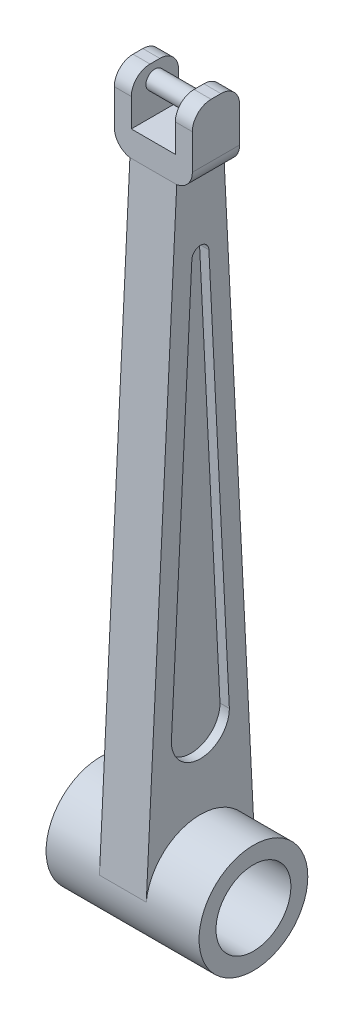
ISO-10303-21;
HEADER;
FILE_DESCRIPTION(('STEP AP214'),'2;1');
FILE_NAME('part.step','',(''),(''),'','','');
FILE_SCHEMA(('AUTOMOTIVE_DESIGN { 1 0 10303 214 1 1 1 1 }'));
ENDSEC;
DATA;
#1=APPLICATION_CONTEXT('core data for automotive mechanical design processes');
#2=APPLICATION_PROTOCOL_DEFINITION('international standard','automotive_design',2000,#1);
#3=PRODUCT_CONTEXT('',#1,'mechanical');
#4=PRODUCT('Part','Part','',(#3));
#5=PRODUCT_RELATED_PRODUCT_CATEGORY('part','',(#4));
#6=PRODUCT_DEFINITION_FORMATION('','',#4);
#7=PRODUCT_DEFINITION_CONTEXT('part definition',#1,'design');
#8=PRODUCT_DEFINITION('design','',#6,#7);
#9=PRODUCT_DEFINITION_SHAPE('','',#8);
#10=(LENGTH_UNIT() NAMED_UNIT(*) SI_UNIT(.MILLI.,.METRE.));
#11=(NAMED_UNIT(*) PLANE_ANGLE_UNIT() SI_UNIT($,.RADIAN.));
#12=(NAMED_UNIT(*) SI_UNIT($,.STERADIAN.) SOLID_ANGLE_UNIT());
#13=UNCERTAINTY_MEASURE_WITH_UNIT(LENGTH_MEASURE(1.E-05),#10,'distance_accuracy_value','');
#14=(GEOMETRIC_REPRESENTATION_CONTEXT(3) GLOBAL_UNCERTAINTY_ASSIGNED_CONTEXT((#13)) GLOBAL_UNIT_ASSIGNED_CONTEXT((#10,
#11,#12)) REPRESENTATION_CONTEXT('',''));
#15=CARTESIAN_POINT('',(0.,0.,0.));
#16=DIRECTION('',(0.,0.,1.));
#17=DIRECTION('',(1.,0.,0.));
#18=AXIS2_PLACEMENT_3D('',#15,#16,#17);
#19=CARTESIAN_POINT('',(6.24999999999999,106.094443710162,3.78478800638868));
#20=DIRECTION('',(0.,1.,0.));
#21=DIRECTION('',(0.,0.,1.));
#22=AXIS2_PLACEMENT_3D('',#19,#20,#21);
#23=PLANE('',#22);
#24=DIRECTION('',(-1.,0.,0.));
#25=VECTOR('',#24,1.);
#26=CARTESIAN_POINT('',(6.24999999999999,106.094443710162,3.78478800638868));
#27=LINE('',#26,#25);
#28=CARTESIAN_POINT('',(3.52500846736764,106.094443710162,3.78478800638868));
#29=VERTEX_POINT('',#28);
#30=CARTESIAN_POINT('',(-3.52500846736764,106.094443710162,3.78478800638868));
#31=VERTEX_POINT('',#30);
#32=EDGE_CURVE('E219',#29,#31,#27,.T.);
#33=ORIENTED_EDGE('',*,*,#32,.F.);
#34=DIRECTION('',(0.,0.,1.));
#35=VECTOR('',#34,1.);
#36=CARTESIAN_POINT('',(3.52500846736764,106.094443710162,-3.78478800638867));
#37=LINE('',#36,#35);
#38=CARTESIAN_POINT('',(3.52500846736764,106.094443710162,-3.78478800638867));
#39=VERTEX_POINT('',#38);
#40=EDGE_CURVE('E217',#39,#29,#37,.T.);
#41=ORIENTED_EDGE('',*,*,#40,.F.);
#42=DIRECTION('',(-1.,0.,0.));
#43=VECTOR('',#42,1.);
#44=CARTESIAN_POINT('',(6.24999999999999,106.094443710162,-3.78478800638867));
#45=LINE('',#44,#43);
#46=CARTESIAN_POINT('',(-3.52500846736764,106.094443710162,-3.78478800638867));
#47=VERTEX_POINT('',#46);
#48=EDGE_CURVE('E203',#39,#47,#45,.T.);
#49=ORIENTED_EDGE('',*,*,#48,.T.);
#50=DIRECTION('',(0.,0.,-1.));
#51=VECTOR('',#50,1.);
#52=CARTESIAN_POINT('',(-3.52500846736764,106.094443710162,-3.78478800638867));
#53=LINE('',#52,#51);
#54=EDGE_CURVE('E215',#31,#47,#53,.T.);
#55=ORIENTED_EDGE('',*,*,#54,.F.);
#56=EDGE_LOOP('',(#33,#41,#49,#55));
#57=FACE_BOUND('',#56,.T.);
#58=ADVANCED_FACE('F38',(#57),#23,.T.);
#59=CARTESIAN_POINT('',(3.75,25.1418620019097,0.));
#60=DIRECTION('',(-1.,0.,0.));
#61=DIRECTION('',(0.,0.,1.));
#62=AXIS2_PLACEMENT_3D('',#59,#60,#61);
#63=CYLINDRICAL_SURFACE('',#62,4.64368791552873);
#64=DIRECTION('',(-1.,0.,0.));
#65=VECTOR('',#64,1.);
#66=CARTESIAN_POINT('',(3.75,25.1418620019097,-4.64368791552873));
#67=LINE('',#66,#65);
#68=CARTESIAN_POINT('',(3.75,25.1418620019097,-4.64368791552873));
#69=VERTEX_POINT('',#68);
#70=CARTESIAN_POINT('',(2.25,25.1418620019097,-4.64368791552873));
#71=VERTEX_POINT('',#70);
#72=EDGE_CURVE('E333',#69,#71,#67,.T.);
#73=ORIENTED_EDGE('',*,*,#72,.T.);
#74=CARTESIAN_POINT('',(2.25,25.1418620019097,0.));
#75=DIRECTION('',(1.,0.,0.));
#76=DIRECTION('',(0.,0.,-1.));
#77=AXIS2_PLACEMENT_3D('',#74,#75,#76);
#78=CIRCLE('',#77,4.64368791552873);
#79=CARTESIAN_POINT('',(2.25,25.1418620019097,4.64368791552872));
#80=VERTEX_POINT('',#79);
#81=EDGE_CURVE('E270',#80,#71,#78,.T.);
#82=ORIENTED_EDGE('',*,*,#81,.F.);
#83=DIRECTION('',(-1.,0.,0.));
#84=VECTOR('',#83,1.);
#85=CARTESIAN_POINT('',(3.75,25.1418620019097,4.64368791552872));
#86=LINE('',#85,#84);
#87=CARTESIAN_POINT('',(3.75,25.1418620019097,4.64368791552872));
#88=VERTEX_POINT('',#87);
#89=EDGE_CURVE('E329',#88,#80,#86,.T.);
#90=ORIENTED_EDGE('',*,*,#89,.F.);
#91=CARTESIAN_POINT('',(3.75,25.1418620019097,0.));
#92=DIRECTION('',(1.,0.,0.));
#93=DIRECTION('',(0.,0.,-1.));
#94=AXIS2_PLACEMENT_3D('',#91,#92,#93);
#95=CIRCLE('',#94,4.64368791552873);
#96=EDGE_CURVE('E285',#88,#69,#95,.T.);
#97=ORIENTED_EDGE('',*,*,#96,.T.);
#98=EDGE_LOOP('',(#73,#82,#90,#97));
#99=FACE_BOUND('',#98,.T.);
#100=ADVANCED_FACE('F469',(#99),#63,.F.);
#101=CARTESIAN_POINT('',(3.75,0.296098394583436,5.89224310639407));
#102=DIRECTION('',(0.,-0.0501889058364647,-0.99873974274129));
#103=DIRECTION('',(0.,0.99873974274129,-0.0501889058364647));
#104=AXIS2_PLACEMENT_3D('',#101,#102,#103);
#105=PLANE('',#104);
#106=ORIENTED_EDGE('',*,*,#89,.T.);
#107=DIRECTION('',(0.,-0.99873974274129,0.0501889058364647));
#108=VECTOR('',#107,1.);
#109=CARTESIAN_POINT('',(2.25,90.3954705550591,1.36454814066158));
#110=LINE('',#109,#108);
#111=CARTESIAN_POINT('',(2.25,90.3954705550591,1.36454814066158));
#112=VERTEX_POINT('',#111);
#113=EDGE_CURVE('E273',#112,#80,#110,.T.);
#114=ORIENTED_EDGE('',*,*,#113,.F.);
#115=DIRECTION('',(-1.,0.,0.));
#116=VECTOR('',#115,1.);
#117=CARTESIAN_POINT('',(3.75,90.3954705550591,1.36454814066158));
#118=LINE('',#117,#116);
#119=CARTESIAN_POINT('',(3.75,90.3954705550591,1.36454814066158));
#120=VERTEX_POINT('',#119);
#121=EDGE_CURVE('E340',#120,#112,#118,.T.);
#122=ORIENTED_EDGE('',*,*,#121,.F.);
#123=DIRECTION('',(0.,-0.99873974274129,0.0501889058364647));
#124=VECTOR('',#123,1.);
#125=CARTESIAN_POINT('',(3.75,0.296098394583436,5.89224310639407));
#126=LINE('',#125,#124);
#127=EDGE_CURVE('E288',#120,#88,#126,.T.);
#128=ORIENTED_EDGE('',*,*,#127,.T.);
#129=EDGE_LOOP('',(#106,#114,#122,#128));
#130=FACE_BOUND('',#129,.T.);
#131=ADVANCED_FACE('F474',(#130),#105,.T.);
#132=CARTESIAN_POINT('',(3.75,90.3268989590665,0.));
#133=DIRECTION('',(-1.,0.,0.));
#134=DIRECTION('',(0.,0.,1.));
#135=AXIS2_PLACEMENT_3D('',#132,#133,#134);
#136=CYLINDRICAL_SURFACE('',#135,1.36626999233678);
#137=CARTESIAN_POINT('',(2.25,90.3268989590665,0.));
#138=DIRECTION('',(-1.,0.,0.));
#139=DIRECTION('',(0.,0.,1.));
#140=AXIS2_PLACEMENT_3D('',#137,#138,#139);
#141=CIRCLE('',#140,1.36626999233678);
#142=CARTESIAN_POINT('',(2.25,90.3954705550591,-1.36454814066158));
#143=VERTEX_POINT('',#142);
#144=EDGE_CURVE('E264',#112,#143,#141,.T.);
#145=ORIENTED_EDGE('',*,*,#144,.T.);
#146=DIRECTION('',(-1.,0.,0.));
#147=VECTOR('',#146,1.);
#148=CARTESIAN_POINT('',(3.75,90.3954705550591,-1.36454814066158));
#149=LINE('',#148,#147);
#150=CARTESIAN_POINT('',(3.75,90.3954705550591,-1.36454814066158));
#151=VERTEX_POINT('',#150);
#152=EDGE_CURVE('E337',#151,#143,#149,.T.);
#153=ORIENTED_EDGE('',*,*,#152,.F.);
#154=CARTESIAN_POINT('',(3.75,90.3268989590665,0.));
#155=DIRECTION('',(1.,0.,0.));
#156=DIRECTION('',(0.,0.,-1.));
#157=AXIS2_PLACEMENT_3D('',#154,#155,#156);
#158=CIRCLE('',#157,1.36626999233678);
#159=EDGE_CURVE('E292',#120,#151,#158,.F.);
#160=ORIENTED_EDGE('',*,*,#159,.F.);
#161=ORIENTED_EDGE('',*,*,#121,.T.);
#162=EDGE_LOOP('',(#145,#153,#160,#161));
#163=FACE_BOUND('',#162,.T.);
#164=ADVANCED_FACE('F530',(#163),#136,.F.);
#165=CARTESIAN_POINT('',(3.75,0.296098394583438,-5.89224310639408));
#166=DIRECTION('',(0.,0.0501889058364649,-0.99873974274129));
#167=DIRECTION('',(0.,0.99873974274129,0.0501889058364649));
#168=AXIS2_PLACEMENT_3D('',#165,#166,#167);
#169=PLANE('',#168);
#170=DIRECTION('',(0.,-0.99873974274129,-0.0501889058364649));
#171=VECTOR('',#170,1.);
#172=CARTESIAN_POINT('',(2.25,90.3954705550591,-1.36454814066158));
#173=LINE('',#172,#171);
#174=EDGE_CURVE('E267',#143,#71,#173,.T.);
#175=ORIENTED_EDGE('',*,*,#174,.T.);
#176=ORIENTED_EDGE('',*,*,#72,.F.);
#177=DIRECTION('',(0.,-0.99873974274129,-0.0501889058364649));
#178=VECTOR('',#177,1.);
#179=CARTESIAN_POINT('',(3.75,0.296098394583438,-5.89224310639408));
#180=LINE('',#179,#178);
#181=EDGE_CURVE('E294',#151,#69,#180,.T.);
#182=ORIENTED_EDGE('',*,*,#181,.F.);
#183=ORIENTED_EDGE('',*,*,#152,.T.);
#184=EDGE_LOOP('',(#175,#176,#182,#183));
#185=FACE_BOUND('',#184,.T.);
#186=ADVANCED_FACE('F521',(#185),#169,.F.);
#187=CARTESIAN_POINT('',(3.75,0.446665112092829,8.88846233461794));
#188=DIRECTION('',(0.,-0.0501889058364646,-0.99873974274129));
#189=DIRECTION('',(0.,0.99873974274129,-0.0501889058364646));
#190=AXIS2_PLACEMENT_3D('',#187,#188,#189);
#191=PLANE('',#190);
#192=DIRECTION('',(0.,-0.99873974274129,0.0501889058364646));
#193=VECTOR('',#192,1.);
#194=CARTESIAN_POINT('',(-3.75,0.446665112092829,8.88846233461794));
#195=LINE('',#194,#193);
#196=CARTESIAN_POINT('',(-3.75,102.00780299025,3.78478800638868));
#197=VERTEX_POINT('',#196);
#198=CARTESIAN_POINT('',(-3.75,4.92404461233952,8.66346400070242));
#199=VERTEX_POINT('',#198);
#200=EDGE_CURVE('E317',#197,#199,#195,.T.);
#201=ORIENTED_EDGE('',*,*,#200,.T.);
#202=DIRECTION('',(1.,0.,0.));
#203=VECTOR('',#202,1.);
#204=CARTESIAN_POINT('',(-12.25,4.92404461233952,8.66346400070242));
#205=LINE('',#204,#203);
#206=CARTESIAN_POINT('',(3.75,4.92404461233952,8.66346400070242));
#207=VERTEX_POINT('',#206);
#208=EDGE_CURVE('E260',#199,#207,#205,.T.);
#209=ORIENTED_EDGE('',*,*,#208,.T.);
#210=DIRECTION('',(0.,-0.99873974274129,0.0501889058364646));
#211=VECTOR('',#210,1.);
#212=CARTESIAN_POINT('',(3.75,0.446665112092829,8.88846233461794));
#213=LINE('',#212,#211);
#214=CARTESIAN_POINT('',(3.75,102.00780299025,3.78478800638868));
#215=VERTEX_POINT('',#214);
#216=EDGE_CURVE('E296',#215,#207,#213,.T.);
#217=ORIENTED_EDGE('',*,*,#216,.F.);
#218=DIRECTION('',(-1.,0.,0.));
#219=VECTOR('',#218,1.);
#220=CARTESIAN_POINT('',(3.75,102.00780299025,3.78478800638868));
#221=LINE('',#220,#219);
#222=EDGE_CURVE('E325',#215,#197,#221,.T.);
#223=ORIENTED_EDGE('',*,*,#222,.T.);
#224=EDGE_LOOP('',(#201,#209,#217,#223));
#225=FACE_BOUND('',#224,.T.);
#226=ADVANCED_FACE('F423',(#225),#191,.F.);
#227=CARTESIAN_POINT('',(3.75,0.446665112092832,-8.88846233461795));
#228=DIRECTION('',(0.,0.0501889058364649,-0.99873974274129));
#229=DIRECTION('',(0.,0.99873974274129,0.0501889058364649));
#230=AXIS2_PLACEMENT_3D('',#227,#228,#229);
#231=PLANE('',#230);
#232=DIRECTION('',(1.,0.,0.));
#233=VECTOR('',#232,1.);
#234=CARTESIAN_POINT('',(-12.25,4.92404461233949,-8.66346400070244));
#235=LINE('',#234,#233);
#236=CARTESIAN_POINT('',(-3.75,4.92404461233949,-8.66346400070244));
#237=VERTEX_POINT('',#236);
#238=CARTESIAN_POINT('',(3.75,4.92404461233949,-8.66346400070244));
#239=VERTEX_POINT('',#238);
#240=EDGE_CURVE('E256',#237,#239,#235,.T.);
#241=ORIENTED_EDGE('',*,*,#240,.F.);
#242=DIRECTION('',(0.,-0.99873974274129,-0.0501889058364649));
#243=VECTOR('',#242,1.);
#244=CARTESIAN_POINT('',(-3.75,0.446665112092832,-8.88846233461795));
#245=LINE('',#244,#243);
#246=CARTESIAN_POINT('',(-3.75,102.00780299025,-3.78478800638867));
#247=VERTEX_POINT('',#246);
#248=EDGE_CURVE('E320',#247,#237,#245,.T.);
#249=ORIENTED_EDGE('',*,*,#248,.F.);
#250=DIRECTION('',(-1.,0.,0.));
#251=VECTOR('',#250,1.);
#252=CARTESIAN_POINT('',(3.75,102.00780299025,-3.78478800638867));
#253=LINE('',#252,#251);
#254=CARTESIAN_POINT('',(3.75,102.00780299025,-3.78478800638867));
#255=VERTEX_POINT('',#254);
#256=EDGE_CURVE('E328',#255,#247,#253,.T.);
#257=ORIENTED_EDGE('',*,*,#256,.F.);
#258=DIRECTION('',(0.,-0.99873974274129,-0.0501889058364649));
#259=VECTOR('',#258,1.);
#260=CARTESIAN_POINT('',(3.75,0.446665112092832,-8.88846233461795));
#261=LINE('',#260,#259);
#262=EDGE_CURVE('E299',#255,#239,#261,.T.);
#263=ORIENTED_EDGE('',*,*,#262,.T.);
#264=EDGE_LOOP('',(#241,#249,#257,#263));
#265=FACE_BOUND('',#264,.T.);
#266=ADVANCED_FACE('F418',(#265),#231,.T.);
#267=CARTESIAN_POINT('',(-2.25,25.1418620019097,0.));
#268=DIRECTION('',(1.,0.,0.));
#269=DIRECTION('',(0.,0.,-1.));
#270=AXIS2_PLACEMENT_3D('',#267,#268,#269);
#271=CIRCLE('',#270,4.64368791552873);
#272=CARTESIAN_POINT('',(-2.25,25.1418620019097,4.64368791552872));
#273=VERTEX_POINT('',#272);
#274=CARTESIAN_POINT('',(-2.25,25.1418620019097,-4.64368791552873));
#275=VERTEX_POINT('',#274);
#276=EDGE_CURVE('E280',#273,#275,#271,.T.);
#277=ORIENTED_EDGE('',*,*,#276,.T.);
#278=CARTESIAN_POINT('',(-3.75,25.1418620019097,-4.64368791552873));
#279=VERTEX_POINT('',#278);
#280=EDGE_CURVE('E305',#275,#279,#67,.T.);
#281=ORIENTED_EDGE('',*,*,#280,.T.);
#282=CARTESIAN_POINT('',(-3.75,25.1418620019097,0.));
#283=DIRECTION('',(1.,0.,0.));
#284=DIRECTION('',(0.,0.,-1.));
#285=AXIS2_PLACEMENT_3D('',#282,#283,#284);
#286=CIRCLE('',#285,4.64368791552873);
#287=CARTESIAN_POINT('',(-3.75,25.1418620019097,4.64368791552872));
#288=VERTEX_POINT('',#287);
#289=EDGE_CURVE('E276',#288,#279,#286,.T.);
#290=ORIENTED_EDGE('',*,*,#289,.F.);
#291=EDGE_CURVE('E343',#273,#288,#86,.T.);
#292=ORIENTED_EDGE('',*,*,#291,.F.);
#293=EDGE_LOOP('',(#277,#281,#290,#292));
#294=FACE_BOUND('',#293,.T.);
#295=ADVANCED_FACE('F477',(#294),#63,.F.);
#296=DIRECTION('',(0.,-0.99873974274129,0.0501889058364647));
#297=VECTOR('',#296,1.);
#298=CARTESIAN_POINT('',(-2.25,90.3954705550591,1.36454814066158));
#299=LINE('',#298,#297);
#300=CARTESIAN_POINT('',(-2.25,90.3954705550591,1.36454814066158));
#301=VERTEX_POINT('',#300);
#302=EDGE_CURVE('E268',#301,#273,#299,.T.);
#303=ORIENTED_EDGE('',*,*,#302,.T.);
#304=ORIENTED_EDGE('',*,*,#291,.T.);
#305=DIRECTION('',(0.,-0.99873974274129,0.0501889058364647));
#306=VECTOR('',#305,1.);
#307=CARTESIAN_POINT('',(-3.75,0.296098394583436,5.89224310639407));
#308=LINE('',#307,#306);
#309=CARTESIAN_POINT('',(-3.75,90.3954705550591,1.36454814066158));
#310=VERTEX_POINT('',#309);
#311=EDGE_CURVE('E308',#310,#288,#308,.T.);
#312=ORIENTED_EDGE('',*,*,#311,.F.);
#313=EDGE_CURVE('E339',#301,#310,#118,.T.);
#314=ORIENTED_EDGE('',*,*,#313,.F.);
#315=EDGE_LOOP('',(#303,#304,#312,#314));
#316=FACE_BOUND('',#315,.T.);
#317=ADVANCED_FACE('F528',(#316),#105,.T.);
#318=CARTESIAN_POINT('',(-2.25,90.3954705550591,-1.36454814066158));
#319=VERTEX_POINT('',#318);
#320=CARTESIAN_POINT('',(-3.75,90.3954705550591,-1.36454814066158));
#321=VERTEX_POINT('',#320);
#322=EDGE_CURVE('E336',#319,#321,#149,.T.);
#323=ORIENTED_EDGE('',*,*,#322,.F.);
#324=CARTESIAN_POINT('',(-2.25,90.3268989590665,0.));
#325=DIRECTION('',(-1.,0.,0.));
#326=DIRECTION('',(0.,0.,1.));
#327=AXIS2_PLACEMENT_3D('',#324,#325,#326);
#328=CIRCLE('',#327,1.36626999233678);
#329=EDGE_CURVE('E259',#301,#319,#328,.T.);
#330=ORIENTED_EDGE('',*,*,#329,.F.);
#331=ORIENTED_EDGE('',*,*,#313,.T.);
#332=CARTESIAN_POINT('',(-3.75,90.3268989590665,0.));
#333=DIRECTION('',(1.,0.,0.));
#334=DIRECTION('',(0.,0.,-1.));
#335=AXIS2_PLACEMENT_3D('',#332,#333,#334);
#336=CIRCLE('',#335,1.36626999233678);
#337=EDGE_CURVE('E311',#310,#321,#336,.F.);
#338=ORIENTED_EDGE('',*,*,#337,.T.);
#339=EDGE_LOOP('',(#323,#330,#331,#338));
#340=FACE_BOUND('',#339,.T.);
#341=ADVANCED_FACE('F524',(#340),#136,.F.);
#342=ORIENTED_EDGE('',*,*,#280,.F.);
#343=DIRECTION('',(0.,-0.99873974274129,-0.0501889058364649));
#344=VECTOR('',#343,1.);
#345=CARTESIAN_POINT('',(-2.25,90.3954705550591,-1.36454814066158));
#346=LINE('',#345,#344);
#347=EDGE_CURVE('E278',#319,#275,#346,.T.);
#348=ORIENTED_EDGE('',*,*,#347,.F.);
#349=ORIENTED_EDGE('',*,*,#322,.T.);
#350=DIRECTION('',(0.,-0.99873974274129,-0.0501889058364649));
#351=VECTOR('',#350,1.);
#352=CARTESIAN_POINT('',(-3.75,0.296098394583438,-5.89224310639408));
#353=LINE('',#352,#351);
#354=EDGE_CURVE('E314',#321,#279,#353,.T.);
#355=ORIENTED_EDGE('',*,*,#354,.T.);
#356=EDGE_LOOP('',(#342,#348,#349,#355));
#357=FACE_BOUND('',#356,.T.);
#358=ADVANCED_FACE('F509',(#357),#169,.F.);
#359=CARTESIAN_POINT('',(3.75,0.,0.));
#360=DIRECTION('',(1.,0.,0.));
#361=DIRECTION('',(0.,0.,-1.));
#362=AXIS2_PLACEMENT_3D('',#359,#360,#361);
#363=PLANE('',#362);
#364=CARTESIAN_POINT('',(3.75,4.05112335020589,0.));
#365=DIRECTION('',(1.,0.,0.));
#366=DIRECTION('',(0.,0.,-1.));
#367=AXIS2_PLACEMENT_3D('',#364,#365,#366);
#368=CIRCLE('',#367,8.70733024648496);
#369=EDGE_CURVE('E257',#239,#207,#368,.T.);
#370=ORIENTED_EDGE('',*,*,#369,.F.);
#371=ORIENTED_EDGE('',*,*,#262,.F.);
#372=DIRECTION('',(0.,0.,-1.));
#373=VECTOR('',#372,1.);
#374=CARTESIAN_POINT('',(3.75,102.00780299025,0.));
#375=LINE('',#374,#373);
#376=EDGE_CURVE('E302',#215,#255,#375,.T.);
#377=ORIENTED_EDGE('',*,*,#376,.F.);
#378=ORIENTED_EDGE('',*,*,#216,.T.);
#379=EDGE_LOOP('',(#370,#371,#377,#378));
#380=FACE_BOUND('',#379,.T.);
#381=ORIENTED_EDGE('',*,*,#96,.F.);
#382=ORIENTED_EDGE('',*,*,#127,.F.);
#383=ORIENTED_EDGE('',*,*,#159,.T.);
#384=ORIENTED_EDGE('',*,*,#181,.T.);
#385=EDGE_LOOP('',(#381,#382,#383,#384));
#386=FACE_BOUND('',#385,.T.);
#387=ADVANCED_FACE('F506',(#380,#386),#363,.T.);
#388=CARTESIAN_POINT('',(-3.75,0.,0.));
#389=DIRECTION('',(1.,0.,0.));
#390=DIRECTION('',(0.,0.,-1.));
#391=AXIS2_PLACEMENT_3D('',#388,#389,#390);
#392=PLANE('',#391);
#393=ORIENTED_EDGE('',*,*,#289,.T.);
#394=ORIENTED_EDGE('',*,*,#354,.F.);
#395=ORIENTED_EDGE('',*,*,#337,.F.);
#396=ORIENTED_EDGE('',*,*,#311,.T.);
#397=EDGE_LOOP('',(#393,#394,#395,#396));
#398=FACE_BOUND('',#397,.T.);
#399=ORIENTED_EDGE('',*,*,#248,.T.);
#400=CARTESIAN_POINT('',(-3.75,4.05112335020589,0.));
#401=DIRECTION('',(1.,0.,0.));
#402=DIRECTION('',(0.,0.,-1.));
#403=AXIS2_PLACEMENT_3D('',#400,#401,#402);
#404=CIRCLE('',#403,8.70733024648496);
#405=EDGE_CURVE('E332',#237,#199,#404,.T.);
#406=ORIENTED_EDGE('',*,*,#405,.T.);
#407=ORIENTED_EDGE('',*,*,#200,.F.);
#408=DIRECTION('',(0.,0.,-1.));
#409=VECTOR('',#408,1.);
#410=CARTESIAN_POINT('',(-3.75,102.00780299025,0.));
#411=LINE('',#410,#409);
#412=EDGE_CURVE('E289',#197,#247,#411,.T.);
#413=ORIENTED_EDGE('',*,*,#412,.T.);
#414=EDGE_LOOP('',(#399,#406,#407,#413));
#415=FACE_BOUND('',#414,.T.);
#416=ADVANCED_FACE('F421',(#398,#415),#392,.F.);
#417=CARTESIAN_POINT('',(-2.25,90.3268989590665,0.));
#418=DIRECTION('',(-1.,0.,0.));
#419=DIRECTION('',(0.,0.,1.));
#420=AXIS2_PLACEMENT_3D('',#417,#418,#419);
#421=PLANE('',#420);
#422=ORIENTED_EDGE('',*,*,#329,.T.);
#423=ORIENTED_EDGE('',*,*,#347,.T.);
#424=ORIENTED_EDGE('',*,*,#276,.F.);
#425=ORIENTED_EDGE('',*,*,#302,.F.);
#426=EDGE_LOOP('',(#422,#423,#424,#425));
#427=FACE_BOUND('',#426,.T.);
#428=ADVANCED_FACE('F501',(#427),#421,.T.);
#429=CARTESIAN_POINT('',(2.25,90.3268989590665,0.));
#430=DIRECTION('',(-1.,0.,0.));
#431=DIRECTION('',(0.,0.,1.));
#432=AXIS2_PLACEMENT_3D('',#429,#430,#431);
#433=PLANE('',#432);
#434=ORIENTED_EDGE('',*,*,#144,.F.);
#435=ORIENTED_EDGE('',*,*,#113,.T.);
#436=ORIENTED_EDGE('',*,*,#81,.T.);
#437=ORIENTED_EDGE('',*,*,#174,.F.);
#438=EDGE_LOOP('',(#434,#435,#436,#437));
#439=FACE_BOUND('',#438,.T.);
#440=ADVANCED_FACE('F494',(#439),#433,.F.);
#441=CARTESIAN_POINT('',(-12.25,4.05112335020589,0.));
#442=DIRECTION('',(1.,0.,0.));
#443=DIRECTION('',(0.,0.,-1.));
#444=AXIS2_PLACEMENT_3D('',#441,#442,#443);
#445=PLANE('',#444);
#446=CARTESIAN_POINT('',(-12.25,4.05112335020589,0.));
#447=DIRECTION('',(1.,0.,0.));
#448=DIRECTION('',(0.,0.,-1.));
#449=AXIS2_PLACEMENT_3D('',#446,#447,#448);
#450=CIRCLE('',#449,6.);
#451=CARTESIAN_POINT('',(-12.25,4.05112335020589,-6.00000000000001));
#452=VERTEX_POINT('',#451);
#453=EDGE_CURVE('E250',#452,#452,#450,.T.);
#454=ORIENTED_EDGE('',*,*,#453,.T.);
#455=EDGE_LOOP('',(#454));
#456=FACE_BOUND('',#455,.T.);
#457=CARTESIAN_POINT('',(-12.25,4.05112335020589,0.));
#458=DIRECTION('',(1.,0.,0.));
#459=DIRECTION('',(0.,0.,-1.));
#460=AXIS2_PLACEMENT_3D('',#457,#458,#459);
#461=CIRCLE('',#460,8.70733024648496);
#462=CARTESIAN_POINT('',(-12.25,4.05112335020589,-8.70733024648497));
#463=VERTEX_POINT('',#462);
#464=EDGE_CURVE('E253',#463,#463,#461,.T.);
#465=ORIENTED_EDGE('',*,*,#464,.F.);
#466=EDGE_LOOP('',(#465));
#467=FACE_BOUND('',#466,.T.);
#468=ADVANCED_FACE('F490',(#456,#467),#445,.F.);
#469=CARTESIAN_POINT('',(12.25,4.05112335020589,0.));
#470=DIRECTION('',(1.,0.,0.));
#471=DIRECTION('',(0.,0.,-1.));
#472=AXIS2_PLACEMENT_3D('',#469,#470,#471);
#473=PLANE('',#472);
#474=CARTESIAN_POINT('',(12.25,4.05112335020589,0.));
#475=DIRECTION('',(1.,0.,0.));
#476=DIRECTION('',(0.,0.,-1.));
#477=AXIS2_PLACEMENT_3D('',#474,#475,#476);
#478=CIRCLE('',#477,8.70733024648496);
#479=CARTESIAN_POINT('',(12.25,4.05112335020589,-8.70733024648497));
#480=VERTEX_POINT('',#479);
#481=EDGE_CURVE('E247',#480,#480,#478,.T.);
#482=ORIENTED_EDGE('',*,*,#481,.T.);
#483=EDGE_LOOP('',(#482));
#484=FACE_BOUND('',#483,.T.);
#485=CARTESIAN_POINT('',(12.25,4.05112335020589,0.));
#486=DIRECTION('',(1.,0.,0.));
#487=DIRECTION('',(0.,0.,-1.));
#488=AXIS2_PLACEMENT_3D('',#485,#486,#487);
#489=CIRCLE('',#488,6.);
#490=CARTESIAN_POINT('',(12.25,4.05112335020589,-6.00000000000001));
#491=VERTEX_POINT('',#490);
#492=EDGE_CURVE('E218',#491,#491,#489,.T.);
#493=ORIENTED_EDGE('',*,*,#492,.F.);
#494=EDGE_LOOP('',(#493));
#495=FACE_BOUND('',#494,.T.);
#496=ADVANCED_FACE('F486',(#484,#495),#473,.T.);
#497=CARTESIAN_POINT('',(-11.75,4.05112335020589,0.));
#498=DIRECTION('',(1.,0.,0.));
#499=DIRECTION('',(0.,0.,-1.));
#500=AXIS2_PLACEMENT_3D('',#497,#498,#499);
#501=CYLINDRICAL_SURFACE('',#500,6.);
#502=ORIENTED_EDGE('',*,*,#453,.F.);
#503=EDGE_LOOP('',(#502));
#504=FACE_BOUND('',#503,.T.);
#505=ORIENTED_EDGE('',*,*,#492,.T.);
#506=EDGE_LOOP('',(#505));
#507=FACE_BOUND('',#506,.T.);
#508=ADVANCED_FACE('F489',(#504,#507),#501,.F.);
#509=CARTESIAN_POINT('',(3.75,4.05112335020589,0.));
#510=DIRECTION('',(-1.,0.,0.));
#511=DIRECTION('',(0.,0.,1.));
#512=AXIS2_PLACEMENT_3D('',#509,#510,#511);
#513=CYLINDRICAL_SURFACE('',#512,8.70733024648496);
#514=ORIENTED_EDGE('',*,*,#240,.T.);
#515=ORIENTED_EDGE('',*,*,#369,.T.);
#516=ORIENTED_EDGE('',*,*,#208,.F.);
#517=ORIENTED_EDGE('',*,*,#405,.F.);
#518=EDGE_LOOP('',(#514,#515,#516,#517));
#519=FACE_BOUND('',#518,.T.);
#520=ORIENTED_EDGE('',*,*,#464,.T.);
#521=EDGE_LOOP('',(#520));
#522=FACE_BOUND('',#521,.T.);
#523=ORIENTED_EDGE('',*,*,#481,.F.);
#524=EDGE_LOOP('',(#523));
#525=FACE_BOUND('',#524,.T.);
#526=ADVANCED_FACE('F485',(#519,#522,#525),#513,.T.);
#527=CARTESIAN_POINT('',(6.24999999999999,106.094443710162,3.78478800638868));
#528=DIRECTION('',(0.,0.,-1.));
#529=DIRECTION('',(-1.,0.,0.));
#530=AXIS2_PLACEMENT_3D('',#527,#528,#529);
#531=PLANE('',#530);
#532=ORIENTED_EDGE('',*,*,#222,.F.);
#533=CARTESIAN_POINT('',(3.24999999999999,104.965842881799,3.78478800638868));
#534=DIRECTION('',(0.,0.,-1.));
#535=DIRECTION('',(-1.,0.,0.));
#536=AXIS2_PLACEMENT_3D('',#533,#534,#535);
#537=CIRCLE('',#536,3.);
#538=CARTESIAN_POINT('',(6.24999999999999,104.965842881799,3.78478800638868));
#539=VERTEX_POINT('',#538);
#540=EDGE_CURVE('E374',#215,#539,#537,.F.);
#541=ORIENTED_EDGE('',*,*,#540,.T.);
#542=DIRECTION('',(0.,-1.,0.));
#543=VECTOR('',#542,1.);
#544=CARTESIAN_POINT('',(6.24999999999999,106.094443710162,3.78478800638868));
#545=LINE('',#544,#543);
#546=CARTESIAN_POINT('',(6.24999999999999,110.594443710162,3.78478800638868));
#547=VERTEX_POINT('',#546);
#548=EDGE_CURVE('E234',#547,#539,#545,.T.);
#549=ORIENTED_EDGE('',*,*,#548,.F.);
#550=DIRECTION('',(1.,0.,0.));
#551=VECTOR('',#550,1.);
#552=CARTESIAN_POINT('',(3.52500846736764,110.594443710162,3.78478800638868));
#553=LINE('',#552,#551);
#554=CARTESIAN_POINT('',(3.52500846736764,110.594443710162,3.78478800638868));
#555=VERTEX_POINT('',#554);
#556=EDGE_CURVE('E370',#547,#555,#553,.F.);
#557=ORIENTED_EDGE('',*,*,#556,.T.);
#558=DIRECTION('',(0.,-1.,0.));
#559=VECTOR('',#558,1.);
#560=CARTESIAN_POINT('',(3.52500846736764,113.594443710162,3.78478800638868));
#561=LINE('',#560,#559);
#562=EDGE_CURVE('E448',#555,#29,#561,.T.);
#563=ORIENTED_EDGE('',*,*,#562,.T.);
#564=ORIENTED_EDGE('',*,*,#32,.T.);
#565=DIRECTION('',(0.,-1.,0.));
#566=VECTOR('',#565,1.);
#567=CARTESIAN_POINT('',(-3.52500846736764,113.594443710162,3.78478800638868));
#568=LINE('',#567,#566);
#569=CARTESIAN_POINT('',(-3.52500846736764,110.594443710162,3.78478800638868));
#570=VERTEX_POINT('',#569);
#571=EDGE_CURVE('E208',#570,#31,#568,.T.);
#572=ORIENTED_EDGE('',*,*,#571,.F.);
#573=DIRECTION('',(1.,0.,0.));
#574=VECTOR('',#573,1.);
#575=CARTESIAN_POINT('',(-6.24999999999999,110.594443710162,3.78478800638868));
#576=LINE('',#575,#574);
#577=CARTESIAN_POINT('',(-6.24999999999999,110.594443710162,3.78478800638868));
#578=VERTEX_POINT('',#577);
#579=EDGE_CURVE('E368',#570,#578,#576,.F.);
#580=ORIENTED_EDGE('',*,*,#579,.T.);
#581=DIRECTION('',(0.,-1.,0.));
#582=VECTOR('',#581,1.);
#583=CARTESIAN_POINT('',(-6.24999999999999,106.094443710162,3.78478800638868));
#584=LINE('',#583,#582);
#585=CARTESIAN_POINT('',(-6.24999999999999,104.965842881799,3.78478800638868));
#586=VERTEX_POINT('',#585);
#587=EDGE_CURVE('E233',#578,#586,#584,.T.);
#588=ORIENTED_EDGE('',*,*,#587,.T.);
#589=CARTESIAN_POINT('',(-3.24999999999999,104.965842881799,3.78478800638868));
#590=DIRECTION('',(0.,0.,-1.));
#591=DIRECTION('',(-1.,0.,0.));
#592=AXIS2_PLACEMENT_3D('',#589,#590,#591);
#593=CIRCLE('',#592,3.);
#594=EDGE_CURVE('E372',#586,#197,#593,.F.);
#595=ORIENTED_EDGE('',*,*,#594,.T.);
#596=EDGE_LOOP('',(#532,#541,#549,#557,#563,#564,#572,#580,#588,#595));
#597=FACE_BOUND('',#596,.T.);
#598=ADVANCED_FACE('F398',(#597),#531,.F.);
#599=CARTESIAN_POINT('',(6.24999999999999,106.094443710162,-3.78478800638867));
#600=DIRECTION('',(0.,0.,-1.));
#601=DIRECTION('',(-1.,0.,0.));
#602=AXIS2_PLACEMENT_3D('',#599,#600,#601);
#603=PLANE('',#602);
#604=DIRECTION('',(0.,-1.,0.));
#605=VECTOR('',#604,1.);
#606=CARTESIAN_POINT('',(6.24999999999999,106.094443710162,-3.78478800638867));
#607=LINE('',#606,#605);
#608=CARTESIAN_POINT('',(6.24999999999999,110.594443710162,-3.78478800638867));
#609=VERTEX_POINT('',#608);
#610=CARTESIAN_POINT('',(6.24999999999999,104.965842881799,-3.78478800638867));
#611=VERTEX_POINT('',#610);
#612=EDGE_CURVE('E237',#609,#611,#607,.T.);
#613=ORIENTED_EDGE('',*,*,#612,.T.);
#614=CARTESIAN_POINT('',(3.24999999999999,104.965842881799,-3.78478800638867));
#615=DIRECTION('',(0.,0.,-1.));
#616=DIRECTION('',(-1.,0.,0.));
#617=AXIS2_PLACEMENT_3D('',#614,#615,#616);
#618=CIRCLE('',#617,3.);
#619=EDGE_CURVE('E366',#611,#255,#618,.T.);
#620=ORIENTED_EDGE('',*,*,#619,.T.);
#621=ORIENTED_EDGE('',*,*,#256,.T.);
#622=CARTESIAN_POINT('',(-3.24999999999999,104.965842881799,-3.78478800638867));
#623=DIRECTION('',(0.,0.,-1.));
#624=DIRECTION('',(-1.,0.,0.));
#625=AXIS2_PLACEMENT_3D('',#622,#623,#624);
#626=CIRCLE('',#625,3.);
#627=CARTESIAN_POINT('',(-6.24999999999999,104.965842881799,-3.78478800638867));
#628=VERTEX_POINT('',#627);
#629=EDGE_CURVE('E364',#247,#628,#626,.T.);
#630=ORIENTED_EDGE('',*,*,#629,.T.);
#631=DIRECTION('',(0.,-1.,0.));
#632=VECTOR('',#631,1.);
#633=CARTESIAN_POINT('',(-6.24999999999999,106.094443710162,-3.78478800638867));
#634=LINE('',#633,#632);
#635=CARTESIAN_POINT('',(-6.24999999999999,110.594443710162,-3.78478800638867));
#636=VERTEX_POINT('',#635);
#637=EDGE_CURVE('E238',#636,#628,#634,.T.);
#638=ORIENTED_EDGE('',*,*,#637,.F.);
#639=DIRECTION('',(-1.,0.,0.));
#640=VECTOR('',#639,1.);
#641=CARTESIAN_POINT('',(6.24999999999999,110.594443710162,-3.78478800638867));
#642=LINE('',#641,#640);
#643=CARTESIAN_POINT('',(-3.52500846736764,110.594443710162,-3.78478800638867));
#644=VERTEX_POINT('',#643);
#645=EDGE_CURVE('E206',#636,#644,#642,.F.);
#646=ORIENTED_EDGE('',*,*,#645,.T.);
#647=DIRECTION('',(0.,-1.,0.));
#648=VECTOR('',#647,1.);
#649=CARTESIAN_POINT('',(-3.52500846736764,113.594443710162,-3.78478800638867));
#650=LINE('',#649,#648);
#651=EDGE_CURVE('E198',#644,#47,#650,.T.);
#652=ORIENTED_EDGE('',*,*,#651,.T.);
#653=ORIENTED_EDGE('',*,*,#48,.F.);
#654=DIRECTION('',(0.,-1.,0.));
#655=VECTOR('',#654,1.);
#656=CARTESIAN_POINT('',(3.52500846736764,113.594443710162,-3.78478800638867));
#657=LINE('',#656,#655);
#658=CARTESIAN_POINT('',(3.52500846736764,110.594443710162,-3.78478800638867));
#659=VERTEX_POINT('',#658);
#660=EDGE_CURVE('E436',#659,#39,#657,.T.);
#661=ORIENTED_EDGE('',*,*,#660,.F.);
#662=DIRECTION('',(-1.,0.,0.));
#663=VECTOR('',#662,1.);
#664=CARTESIAN_POINT('',(6.24999999999999,110.594443710162,-3.78478800638867));
#665=LINE('',#664,#663);
#666=EDGE_CURVE('E362',#659,#609,#665,.F.);
#667=ORIENTED_EDGE('',*,*,#666,.T.);
#668=EDGE_LOOP('',(#613,#620,#621,#630,#638,#646,#652,#653,#661,#667));
#669=FACE_BOUND('',#668,.T.);
#670=ADVANCED_FACE('F201',(#669),#603,.T.);
#671=CARTESIAN_POINT('',(6.24999999999999,0.,0.));
#672=DIRECTION('',(1.,0.,0.));
#673=DIRECTION('',(0.,0.,-1.));
#674=AXIS2_PLACEMENT_3D('',#671,#672,#673);
#675=PLANE('',#674);
#676=ORIENTED_EDGE('',*,*,#548,.T.);
#677=DIRECTION('',(0.,0.,1.));
#678=VECTOR('',#677,1.);
#679=CARTESIAN_POINT('',(6.24999999999999,104.965842881799,-3.78478800638867));
#680=LINE('',#679,#678);
#681=EDGE_CURVE('E358',#539,#611,#680,.F.);
#682=ORIENTED_EDGE('',*,*,#681,.T.);
#683=ORIENTED_EDGE('',*,*,#612,.F.);
#684=CARTESIAN_POINT('',(6.24999999999999,110.594443710162,-0.784788006388672));
#685=DIRECTION('',(1.,0.,0.));
#686=DIRECTION('',(0.,0.,-1.));
#687=AXIS2_PLACEMENT_3D('',#684,#685,#686);
#688=CIRCLE('',#687,3.);
#689=CARTESIAN_POINT('',(6.24999999999999,113.594443710162,-0.784788006388673));
#690=VERTEX_POINT('',#689);
#691=EDGE_CURVE('E354',#609,#690,#688,.T.);
#692=ORIENTED_EDGE('',*,*,#691,.T.);
#693=DIRECTION('',(0.,0.,-1.));
#694=VECTOR('',#693,1.);
#695=CARTESIAN_POINT('',(6.24999999999999,113.594443710162,-3.78478800638867));
#696=LINE('',#695,#694);
#697=CARTESIAN_POINT('',(6.24999999999999,113.594443710162,0.78478800638868));
#698=VERTEX_POINT('',#697);
#699=EDGE_CURVE('E442',#698,#690,#696,.T.);
#700=ORIENTED_EDGE('',*,*,#699,.F.);
#701=CARTESIAN_POINT('',(6.24999999999999,110.594443710162,0.784788006388682));
#702=DIRECTION('',(1.,0.,0.));
#703=DIRECTION('',(0.,0.,-1.));
#704=AXIS2_PLACEMENT_3D('',#701,#702,#703);
#705=CIRCLE('',#704,3.);
#706=EDGE_CURVE('E356',#698,#547,#705,.T.);
#707=ORIENTED_EDGE('',*,*,#706,.T.);
#708=EDGE_LOOP('',(#676,#682,#683,#692,#700,#707));
#709=FACE_BOUND('',#708,.T.);
#710=ADVANCED_FACE('F432',(#709),#675,.T.);
#711=CARTESIAN_POINT('',(-6.24999999999999,0.,0.));
#712=DIRECTION('',(1.,0.,0.));
#713=DIRECTION('',(0.,0.,-1.));
#714=AXIS2_PLACEMENT_3D('',#711,#712,#713);
#715=PLANE('',#714);
#716=ORIENTED_EDGE('',*,*,#637,.T.);
#717=DIRECTION('',(0.,0.,-1.));
#718=VECTOR('',#717,1.);
#719=CARTESIAN_POINT('',(-6.24999999999999,104.965842881799,0.));
#720=LINE('',#719,#718);
#721=EDGE_CURVE('E380',#628,#586,#720,.F.);
#722=ORIENTED_EDGE('',*,*,#721,.T.);
#723=ORIENTED_EDGE('',*,*,#587,.F.);
#724=CARTESIAN_POINT('',(-6.24999999999999,110.594443710162,0.784788006388682));
#725=DIRECTION('',(1.,0.,0.));
#726=DIRECTION('',(0.,0.,-1.));
#727=AXIS2_PLACEMENT_3D('',#724,#725,#726);
#728=CIRCLE('',#727,3.);
#729=CARTESIAN_POINT('',(-6.24999999999999,113.594443710162,0.78478800638868));
#730=VERTEX_POINT('',#729);
#731=EDGE_CURVE('E376',#578,#730,#728,.F.);
#732=ORIENTED_EDGE('',*,*,#731,.T.);
#733=DIRECTION('',(0.,0.,1.));
#734=VECTOR('',#733,1.);
#735=CARTESIAN_POINT('',(-6.24999999999999,113.594443710162,-3.78478800638867));
#736=LINE('',#735,#734);
#737=CARTESIAN_POINT('',(-6.24999999999999,113.594443710162,-0.784788006388673));
#738=VERTEX_POINT('',#737);
#739=EDGE_CURVE('E224',#738,#730,#736,.T.);
#740=ORIENTED_EDGE('',*,*,#739,.F.);
#741=CARTESIAN_POINT('',(-6.24999999999999,110.594443710162,-0.784788006388672));
#742=DIRECTION('',(1.,0.,0.));
#743=DIRECTION('',(0.,0.,-1.));
#744=AXIS2_PLACEMENT_3D('',#741,#742,#743);
#745=CIRCLE('',#744,3.);
#746=EDGE_CURVE('E378',#738,#636,#745,.F.);
#747=ORIENTED_EDGE('',*,*,#746,.T.);
#748=EDGE_LOOP('',(#716,#722,#723,#732,#740,#747));
#749=FACE_BOUND('',#748,.T.);
#750=ADVANCED_FACE('F403',(#749),#715,.F.);
#751=CARTESIAN_POINT('',(-3.52500846736764,113.594443710162,-3.78478800638867));
#752=DIRECTION('',(-1.,0.,0.));
#753=DIRECTION('',(0.,0.,1.));
#754=AXIS2_PLACEMENT_3D('',#751,#752,#753);
#755=PLANE('',#754);
#756=CARTESIAN_POINT('',(-3.52500846736764,111.076861872128,0.));
#757=DIRECTION('',(-1.,0.,0.));
#758=DIRECTION('',(0.,0.,1.));
#759=AXIS2_PLACEMENT_3D('',#756,#757,#758);
#760=CIRCLE('',#759,1.44121307327948);
#761=CARTESIAN_POINT('',(-3.52500846736764,111.076861872128,1.44121307327949));
#762=VERTEX_POINT('',#761);
#763=EDGE_CURVE('E351',#762,#762,#760,.F.);
#764=ORIENTED_EDGE('',*,*,#763,.F.);
#765=EDGE_LOOP('',(#764));
#766=FACE_BOUND('',#765,.T.);
#767=ORIENTED_EDGE('',*,*,#651,.F.);
#768=CARTESIAN_POINT('',(-3.52500846736764,110.594443710162,-0.784788006388672));
#769=DIRECTION('',(-1.,0.,0.));
#770=DIRECTION('',(0.,0.,1.));
#771=AXIS2_PLACEMENT_3D('',#768,#769,#770);
#772=CIRCLE('',#771,3.);
#773=CARTESIAN_POINT('',(-3.52500846736764,113.594443710162,-0.784788006388673));
#774=VERTEX_POINT('',#773);
#775=EDGE_CURVE('E11',#644,#774,#772,.F.);
#776=ORIENTED_EDGE('',*,*,#775,.T.);
#777=DIRECTION('',(0.,0.,-1.));
#778=VECTOR('',#777,1.);
#779=CARTESIAN_POINT('',(-3.52500846736764,113.594443710162,-3.78478800638867));
#780=LINE('',#779,#778);
#781=CARTESIAN_POINT('',(-3.52500846736764,113.594443710162,0.78478800638868));
#782=VERTEX_POINT('',#781);
#783=EDGE_CURVE('E209',#782,#774,#780,.T.);
#784=ORIENTED_EDGE('',*,*,#783,.F.);
#785=CARTESIAN_POINT('',(-3.52500846736764,110.594443710162,0.784788006388682));
#786=DIRECTION('',(-1.,0.,0.));
#787=DIRECTION('',(0.,0.,1.));
#788=AXIS2_PLACEMENT_3D('',#785,#786,#787);
#789=CIRCLE('',#788,3.);
#790=EDGE_CURVE('E46',#782,#570,#789,.F.);
#791=ORIENTED_EDGE('',*,*,#790,.T.);
#792=ORIENTED_EDGE('',*,*,#571,.T.);
#793=ORIENTED_EDGE('',*,*,#54,.T.);
#794=EDGE_LOOP('',(#767,#776,#784,#791,#792,#793));
#795=FACE_BOUND('',#794,.T.);
#796=ADVANCED_FACE('F221',(#766,#795),#755,.F.);
#797=CARTESIAN_POINT('',(0.,113.594443710162,0.));
#798=DIRECTION('',(0.,1.,0.));
#799=DIRECTION('',(0.,0.,1.));
#800=AXIS2_PLACEMENT_3D('',#797,#798,#799);
#801=PLANE('',#800);
#802=ORIENTED_EDGE('',*,*,#783,.T.);
#803=DIRECTION('',(-1.,0.,0.));
#804=VECTOR('',#803,1.);
#805=CARTESIAN_POINT('',(0.,113.594443710162,-0.784788006388672));
#806=LINE('',#805,#804);
#807=EDGE_CURVE('E394',#774,#738,#806,.T.);
#808=ORIENTED_EDGE('',*,*,#807,.T.);
#809=ORIENTED_EDGE('',*,*,#739,.T.);
#810=DIRECTION('',(1.,0.,0.));
#811=VECTOR('',#810,1.);
#812=CARTESIAN_POINT('',(-3.52500846736764,113.594443710162,0.784788006388682));
#813=LINE('',#812,#811);
#814=EDGE_CURVE('E392',#730,#782,#813,.T.);
#815=ORIENTED_EDGE('',*,*,#814,.T.);
#816=EDGE_LOOP('',(#802,#808,#809,#815));
#817=FACE_BOUND('',#816,.T.);
#818=ADVANCED_FACE('F405',(#817),#801,.T.);
#819=CARTESIAN_POINT('',(3.52500846736764,113.594443710162,-3.78478800638867));
#820=DIRECTION('',(1.,0.,0.));
#821=DIRECTION('',(0.,0.,-1.));
#822=AXIS2_PLACEMENT_3D('',#819,#820,#821);
#823=PLANE('',#822);
#824=CARTESIAN_POINT('',(3.52500846736764,111.076861872128,0.));
#825=DIRECTION('',(1.,0.,0.));
#826=DIRECTION('',(0.,0.,-1.));
#827=AXIS2_PLACEMENT_3D('',#824,#825,#826);
#828=CIRCLE('',#827,1.44121307327948);
#829=CARTESIAN_POINT('',(3.52500846736764,111.076861872128,-1.44121307327947));
#830=VERTEX_POINT('',#829);
#831=EDGE_CURVE('E348',#830,#830,#828,.F.);
#832=ORIENTED_EDGE('',*,*,#831,.F.);
#833=EDGE_LOOP('',(#832));
#834=FACE_BOUND('',#833,.T.);
#835=ORIENTED_EDGE('',*,*,#562,.F.);
#836=CARTESIAN_POINT('',(3.52500846736764,110.594443710162,0.784788006388682));
#837=DIRECTION('',(1.,0.,0.));
#838=DIRECTION('',(0.,0.,-1.));
#839=AXIS2_PLACEMENT_3D('',#836,#837,#838);
#840=CIRCLE('',#839,3.);
#841=CARTESIAN_POINT('',(3.52500846736764,113.594443710162,0.78478800638868));
#842=VERTEX_POINT('',#841);
#843=EDGE_CURVE('E390',#555,#842,#840,.F.);
#844=ORIENTED_EDGE('',*,*,#843,.T.);
#845=DIRECTION('',(0.,0.,1.));
#846=VECTOR('',#845,1.);
#847=CARTESIAN_POINT('',(3.52500846736764,113.594443710162,-3.78478800638867));
#848=LINE('',#847,#846);
#849=CARTESIAN_POINT('',(3.52500846736764,113.594443710162,-0.784788006388673));
#850=VERTEX_POINT('',#849);
#851=EDGE_CURVE('E228',#850,#842,#848,.T.);
#852=ORIENTED_EDGE('',*,*,#851,.F.);
#853=CARTESIAN_POINT('',(3.52500846736764,110.594443710162,-0.784788006388672));
#854=DIRECTION('',(1.,0.,0.));
#855=DIRECTION('',(0.,0.,-1.));
#856=AXIS2_PLACEMENT_3D('',#853,#854,#855);
#857=CIRCLE('',#856,3.);
#858=EDGE_CURVE('E388',#850,#659,#857,.F.);
#859=ORIENTED_EDGE('',*,*,#858,.T.);
#860=ORIENTED_EDGE('',*,*,#660,.T.);
#861=ORIENTED_EDGE('',*,*,#40,.T.);
#862=EDGE_LOOP('',(#835,#844,#852,#859,#860,#861));
#863=FACE_BOUND('',#862,.T.);
#864=ADVANCED_FACE('F455',(#834,#863),#823,.F.);
#865=CARTESIAN_POINT('',(0.,113.594443710162,0.));
#866=DIRECTION('',(0.,1.,0.));
#867=DIRECTION('',(0.,0.,1.));
#868=AXIS2_PLACEMENT_3D('',#865,#866,#867);
#869=PLANE('',#868);
#870=ORIENTED_EDGE('',*,*,#851,.T.);
#871=DIRECTION('',(1.,0.,0.));
#872=VECTOR('',#871,1.);
#873=CARTESIAN_POINT('',(6.24999999999999,113.594443710162,0.784788006388682));
#874=LINE('',#873,#872);
#875=EDGE_CURVE('E385',#842,#698,#874,.T.);
#876=ORIENTED_EDGE('',*,*,#875,.T.);
#877=ORIENTED_EDGE('',*,*,#699,.T.);
#878=DIRECTION('',(-1.,0.,0.));
#879=VECTOR('',#878,1.);
#880=CARTESIAN_POINT('',(0.,113.594443710162,-0.784788006388672));
#881=LINE('',#880,#879);
#882=EDGE_CURVE('E382',#690,#850,#881,.T.);
#883=ORIENTED_EDGE('',*,*,#882,.T.);
#884=EDGE_LOOP('',(#870,#876,#877,#883));
#885=FACE_BOUND('',#884,.T.);
#886=ADVANCED_FACE('F445',(#885),#869,.T.);
#887=CARTESIAN_POINT('',(4.97499153263234,111.076861872128,0.));
#888=DIRECTION('',(-1.,0.,0.));
#889=DIRECTION('',(0.,0.,1.));
#890=AXIS2_PLACEMENT_3D('',#887,#888,#889);
#891=CYLINDRICAL_SURFACE('',#890,1.44121307327948);
#892=ORIENTED_EDGE('',*,*,#763,.T.);
#893=EDGE_LOOP('',(#892));
#894=FACE_BOUND('',#893,.T.);
#895=ORIENTED_EDGE('',*,*,#831,.T.);
#896=EDGE_LOOP('',(#895));
#897=FACE_BOUND('',#896,.T.);
#898=ADVANCED_FACE('F537',(#894,#897),#891,.T.);
#899=CARTESIAN_POINT('',(3.24999999999999,104.965842881799,3.78478800638868));
#900=DIRECTION('',(0.,0.,-1.));
#901=DIRECTION('',(-1.,0.,0.));
#902=AXIS2_PLACEMENT_3D('',#899,#900,#901);
#903=CYLINDRICAL_SURFACE('',#902,3.);
#904=ORIENTED_EDGE('',*,*,#540,.F.);
#905=ORIENTED_EDGE('',*,*,#376,.T.);
#906=ORIENTED_EDGE('',*,*,#619,.F.);
#907=ORIENTED_EDGE('',*,*,#681,.F.);
#908=EDGE_LOOP('',(#904,#905,#906,#907));
#909=FACE_BOUND('',#908,.T.);
#910=ADVANCED_FACE('F429',(#909),#903,.T.);
#911=CARTESIAN_POINT('',(-3.24999999999999,104.965842881799,3.78478800638868));
#912=DIRECTION('',(0.,0.,-1.));
#913=DIRECTION('',(-1.,0.,0.));
#914=AXIS2_PLACEMENT_3D('',#911,#912,#913);
#915=CYLINDRICAL_SURFACE('',#914,3.);
#916=ORIENTED_EDGE('',*,*,#594,.F.);
#917=ORIENTED_EDGE('',*,*,#721,.F.);
#918=ORIENTED_EDGE('',*,*,#629,.F.);
#919=ORIENTED_EDGE('',*,*,#412,.F.);
#920=EDGE_LOOP('',(#916,#917,#918,#919));
#921=FACE_BOUND('',#920,.T.);
#922=ADVANCED_FACE('F415',(#921),#915,.T.);
#923=CARTESIAN_POINT('',(0.,110.594443710162,0.784788006388682));
#924=DIRECTION('',(-1.,0.,0.));
#925=DIRECTION('',(0.,0.,1.));
#926=AXIS2_PLACEMENT_3D('',#923,#924,#925);
#927=CYLINDRICAL_SURFACE('',#926,3.);
#928=ORIENTED_EDGE('',*,*,#843,.F.);
#929=ORIENTED_EDGE('',*,*,#556,.F.);
#930=ORIENTED_EDGE('',*,*,#706,.F.);
#931=ORIENTED_EDGE('',*,*,#875,.F.);
#932=EDGE_LOOP('',(#928,#929,#930,#931));
#933=FACE_BOUND('',#932,.T.);
#934=ADVANCED_FACE('F458',(#933),#927,.T.);
#935=CARTESIAN_POINT('',(0.,110.594443710162,-0.784788006388672));
#936=DIRECTION('',(-1.,0.,0.));
#937=DIRECTION('',(0.,0.,1.));
#938=AXIS2_PLACEMENT_3D('',#935,#936,#937);
#939=CYLINDRICAL_SURFACE('',#938,3.);
#940=ORIENTED_EDGE('',*,*,#691,.F.);
#941=ORIENTED_EDGE('',*,*,#666,.F.);
#942=ORIENTED_EDGE('',*,*,#858,.F.);
#943=ORIENTED_EDGE('',*,*,#882,.F.);
#944=EDGE_LOOP('',(#940,#941,#942,#943));
#945=FACE_BOUND('',#944,.T.);
#946=ADVANCED_FACE('F438',(#945),#939,.T.);
#947=CARTESIAN_POINT('',(0.,110.594443710162,-0.784788006388672));
#948=DIRECTION('',(-1.,0.,0.));
#949=DIRECTION('',(0.,0.,1.));
#950=AXIS2_PLACEMENT_3D('',#947,#948,#949);
#951=CYLINDRICAL_SURFACE('',#950,3.);
#952=ORIENTED_EDGE('',*,*,#775,.F.);
#953=ORIENTED_EDGE('',*,*,#645,.F.);
#954=ORIENTED_EDGE('',*,*,#746,.F.);
#955=ORIENTED_EDGE('',*,*,#807,.F.);
#956=EDGE_LOOP('',(#952,#953,#954,#955));
#957=FACE_BOUND('',#956,.T.);
#958=ADVANCED_FACE('F408',(#957),#951,.T.);
#959=CARTESIAN_POINT('',(0.,110.594443710162,0.784788006388682));
#960=DIRECTION('',(-1.,0.,0.));
#961=DIRECTION('',(0.,0.,1.));
#962=AXIS2_PLACEMENT_3D('',#959,#960,#961);
#963=CYLINDRICAL_SURFACE('',#962,3.);
#964=ORIENTED_EDGE('',*,*,#731,.F.);
#965=ORIENTED_EDGE('',*,*,#579,.F.);
#966=ORIENTED_EDGE('',*,*,#790,.F.);
#967=ORIENTED_EDGE('',*,*,#814,.F.);
#968=EDGE_LOOP('',(#964,#965,#966,#967));
#969=FACE_BOUND('',#968,.T.);
#970=ADVANCED_FACE('F40',(#969),#963,.T.);
#971=CLOSED_SHELL('',(#58,#100,#131,#164,#186,#226,#266,#295,#317,#341,#358,#387,#416,#428,#440,
#468,#496,#508,#526,#598,#670,#710,#750,#796,#818,#864,#886,#898,#910,#922,#934,#946,#958,#970));
#972=MANIFOLD_SOLID_BREP('B2',#971);
#973=ADVANCED_BREP_SHAPE_REPRESENTATION('',(#18,#972),#14);
#974=SHAPE_DEFINITION_REPRESENTATION(#9,#973);
ENDSEC;
END-ISO-10303-21;
